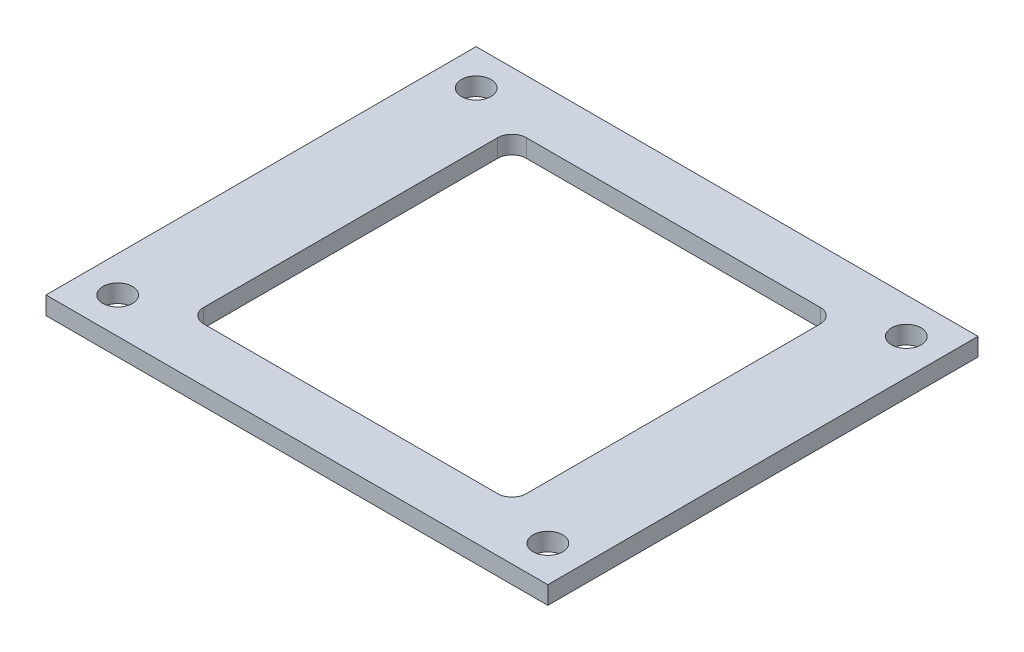
ISO-10303-21;
HEADER;
FILE_DESCRIPTION(('STEP AP214'),'2;1');
FILE_NAME('part.step','',(''),(''),'','','');
FILE_SCHEMA(('AUTOMOTIVE_DESIGN { 1 0 10303 214 1 1 1 1 }'));
ENDSEC;
DATA;
#1=APPLICATION_CONTEXT('core data for automotive mechanical design processes');
#2=APPLICATION_PROTOCOL_DEFINITION('international standard','automotive_design',2000,#1);
#3=PRODUCT_CONTEXT('',#1,'mechanical');
#4=PRODUCT('Part','Part','',(#3));
#5=PRODUCT_RELATED_PRODUCT_CATEGORY('part','',(#4));
#6=PRODUCT_DEFINITION_FORMATION('','',#4);
#7=PRODUCT_DEFINITION_CONTEXT('part definition',#1,'design');
#8=PRODUCT_DEFINITION('design','',#6,#7);
#9=PRODUCT_DEFINITION_SHAPE('','',#8);
#10=(LENGTH_UNIT() NAMED_UNIT(*) SI_UNIT(.MILLI.,.METRE.));
#11=(NAMED_UNIT(*) PLANE_ANGLE_UNIT() SI_UNIT($,.RADIAN.));
#12=(NAMED_UNIT(*) SI_UNIT($,.STERADIAN.) SOLID_ANGLE_UNIT());
#13=UNCERTAINTY_MEASURE_WITH_UNIT(LENGTH_MEASURE(1.E-05),#10,'distance_accuracy_value','');
#14=(GEOMETRIC_REPRESENTATION_CONTEXT(3) GLOBAL_UNCERTAINTY_ASSIGNED_CONTEXT((#13)) GLOBAL_UNIT_ASSIGNED_CONTEXT((#10,
#11,#12)) REPRESENTATION_CONTEXT('',''));
#15=CARTESIAN_POINT('',(0.,0.,0.));
#16=DIRECTION('',(0.,0.,1.));
#17=DIRECTION('',(1.,0.,0.));
#18=AXIS2_PLACEMENT_3D('',#15,#16,#17);
#19=CARTESIAN_POINT('',(0.,2.,24.));
#20=DIRECTION('',(0.,0.,-1.));
#21=DIRECTION('',(-1.,0.,0.));
#22=AXIS2_PLACEMENT_3D('',#19,#20,#21);
#23=PLANE('',#22);
#24=DIRECTION('',(1.,0.,0.));
#25=VECTOR('',#24,1.);
#26=CARTESIAN_POINT('',(0.,0.,24.));
#27=LINE('',#26,#25);
#28=CARTESIAN_POINT('',(-28.,0.,24.));
#29=VERTEX_POINT('',#28);
#30=CARTESIAN_POINT('',(28.,0.,24.));
#31=VERTEX_POINT('',#30);
#32=EDGE_CURVE('E152',#29,#31,#27,.T.);
#33=ORIENTED_EDGE('',*,*,#32,.T.);
#34=DIRECTION('',(0.,-1.,0.));
#35=VECTOR('',#34,1.);
#36=CARTESIAN_POINT('',(28.,2.,24.));
#37=LINE('',#36,#35);
#38=CARTESIAN_POINT('',(28.,2.,24.));
#39=VERTEX_POINT('',#38);
#40=EDGE_CURVE('E134',#39,#31,#37,.T.);
#41=ORIENTED_EDGE('',*,*,#40,.F.);
#42=DIRECTION('',(1.,0.,0.));
#43=VECTOR('',#42,1.);
#44=CARTESIAN_POINT('',(0.,2.,24.));
#45=LINE('',#44,#43);
#46=CARTESIAN_POINT('',(-28.,2.,24.));
#47=VERTEX_POINT('',#46);
#48=EDGE_CURVE('E141',#47,#39,#45,.T.);
#49=ORIENTED_EDGE('',*,*,#48,.F.);
#50=DIRECTION('',(0.,-1.,0.));
#51=VECTOR('',#50,1.);
#52=CARTESIAN_POINT('',(-28.,2.,24.));
#53=LINE('',#52,#51);
#54=EDGE_CURVE('E216',#47,#29,#53,.T.);
#55=ORIENTED_EDGE('',*,*,#54,.T.);
#56=EDGE_LOOP('',(#33,#41,#49,#55));
#57=FACE_BOUND('',#56,.T.);
#58=ADVANCED_FACE('F41',(#57),#23,.F.);
#59=CARTESIAN_POINT('',(28.,2.,0.));
#60=DIRECTION('',(-1.,0.,0.));
#61=DIRECTION('',(0.,0.,1.));
#62=AXIS2_PLACEMENT_3D('',#59,#60,#61);
#63=PLANE('',#62);
#64=DIRECTION('',(0.,0.,-1.));
#65=VECTOR('',#64,1.);
#66=CARTESIAN_POINT('',(28.,0.,0.));
#67=LINE('',#66,#65);
#68=CARTESIAN_POINT('',(28.,0.,-24.));
#69=VERTEX_POINT('',#68);
#70=EDGE_CURVE('E235',#31,#69,#67,.T.);
#71=ORIENTED_EDGE('',*,*,#70,.T.);
#72=DIRECTION('',(0.,-1.,0.));
#73=VECTOR('',#72,1.);
#74=CARTESIAN_POINT('',(28.,2.,-24.));
#75=LINE('',#74,#73);
#76=CARTESIAN_POINT('',(28.,2.,-24.));
#77=VERTEX_POINT('',#76);
#78=EDGE_CURVE('E137',#77,#69,#75,.T.);
#79=ORIENTED_EDGE('',*,*,#78,.F.);
#80=DIRECTION('',(0.,0.,-1.));
#81=VECTOR('',#80,1.);
#82=CARTESIAN_POINT('',(28.,2.,0.));
#83=LINE('',#82,#81);
#84=EDGE_CURVE('E130',#39,#77,#83,.T.);
#85=ORIENTED_EDGE('',*,*,#84,.F.);
#86=ORIENTED_EDGE('',*,*,#40,.T.);
#87=EDGE_LOOP('',(#71,#79,#85,#86));
#88=FACE_BOUND('',#87,.T.);
#89=ADVANCED_FACE('F132',(#88),#63,.F.);
#90=CARTESIAN_POINT('',(0.,2.,-24.));
#91=DIRECTION('',(0.,0.,1.));
#92=DIRECTION('',(1.,0.,0.));
#93=AXIS2_PLACEMENT_3D('',#90,#91,#92);
#94=PLANE('',#93);
#95=DIRECTION('',(-1.,0.,0.));
#96=VECTOR('',#95,1.);
#97=CARTESIAN_POINT('',(0.,0.,-24.));
#98=LINE('',#97,#96);
#99=CARTESIAN_POINT('',(-28.,0.,-24.));
#100=VERTEX_POINT('',#99);
#101=EDGE_CURVE('E237',#69,#100,#98,.T.);
#102=ORIENTED_EDGE('',*,*,#101,.T.);
#103=DIRECTION('',(0.,-1.,0.));
#104=VECTOR('',#103,1.);
#105=CARTESIAN_POINT('',(-28.,2.,-24.));
#106=LINE('',#105,#104);
#107=CARTESIAN_POINT('',(-28.,2.,-24.));
#108=VERTEX_POINT('',#107);
#109=EDGE_CURVE('E157',#108,#100,#106,.T.);
#110=ORIENTED_EDGE('',*,*,#109,.F.);
#111=DIRECTION('',(-1.,0.,0.));
#112=VECTOR('',#111,1.);
#113=CARTESIAN_POINT('',(0.,2.,-24.));
#114=LINE('',#113,#112);
#115=EDGE_CURVE('E140',#77,#108,#114,.T.);
#116=ORIENTED_EDGE('',*,*,#115,.F.);
#117=ORIENTED_EDGE('',*,*,#78,.T.);
#118=EDGE_LOOP('',(#102,#110,#116,#117));
#119=FACE_BOUND('',#118,.T.);
#120=ADVANCED_FACE('F250',(#119),#94,.F.);
#121=CARTESIAN_POINT('',(18.,2.,0.));
#122=DIRECTION('',(-1.,0.,0.));
#123=DIRECTION('',(0.,0.,1.));
#124=AXIS2_PLACEMENT_3D('',#121,#122,#123);
#125=PLANE('',#124);
#126=DIRECTION('',(0.,0.,-1.));
#127=VECTOR('',#126,1.);
#128=CARTESIAN_POINT('',(18.,0.,0.));
#129=LINE('',#128,#127);
#130=CARTESIAN_POINT('',(18.,0.,16.4));
#131=VERTEX_POINT('',#130);
#132=CARTESIAN_POINT('',(18.,0.,-16.4));
#133=VERTEX_POINT('',#132);
#134=EDGE_CURVE('E229',#131,#133,#129,.T.);
#135=ORIENTED_EDGE('',*,*,#134,.F.);
#136=DIRECTION('',(0.,-1.,0.));
#137=VECTOR('',#136,1.);
#138=CARTESIAN_POINT('',(18.,2.,16.4));
#139=LINE('',#138,#137);
#140=CARTESIAN_POINT('',(18.,2.,16.4));
#141=VERTEX_POINT('',#140);
#142=EDGE_CURVE('E171',#131,#141,#139,.F.);
#143=ORIENTED_EDGE('',*,*,#142,.T.);
#144=DIRECTION('',(0.,0.,-1.));
#145=VECTOR('',#144,1.);
#146=CARTESIAN_POINT('',(18.,2.,0.));
#147=LINE('',#146,#145);
#148=CARTESIAN_POINT('',(18.,2.,-16.4));
#149=VERTEX_POINT('',#148);
#150=EDGE_CURVE('E313',#141,#149,#147,.T.);
#151=ORIENTED_EDGE('',*,*,#150,.T.);
#152=DIRECTION('',(0.,-1.,0.));
#153=VECTOR('',#152,1.);
#154=CARTESIAN_POINT('',(18.,2.,-16.4));
#155=LINE('',#154,#153);
#156=EDGE_CURVE('E168',#149,#133,#155,.T.);
#157=ORIENTED_EDGE('',*,*,#156,.T.);
#158=EDGE_LOOP('',(#135,#143,#151,#157));
#159=FACE_BOUND('',#158,.T.);
#160=ADVANCED_FACE('F282',(#159),#125,.T.);
#161=CARTESIAN_POINT('',(0.,2.,18.));
#162=DIRECTION('',(0.,0.,-1.));
#163=DIRECTION('',(-1.,0.,0.));
#164=AXIS2_PLACEMENT_3D('',#161,#162,#163);
#165=PLANE('',#164);
#166=DIRECTION('',(1.,0.,0.));
#167=VECTOR('',#166,1.);
#168=CARTESIAN_POINT('',(0.,0.,18.));
#169=LINE('',#168,#167);
#170=CARTESIAN_POINT('',(-16.4,0.,18.));
#171=VERTEX_POINT('',#170);
#172=CARTESIAN_POINT('',(16.4,0.,18.));
#173=VERTEX_POINT('',#172);
#174=EDGE_CURVE('E204',#171,#173,#169,.T.);
#175=ORIENTED_EDGE('',*,*,#174,.F.);
#176=DIRECTION('',(0.,-1.,0.));
#177=VECTOR('',#176,1.);
#178=CARTESIAN_POINT('',(-16.4,2.,18.));
#179=LINE('',#178,#177);
#180=CARTESIAN_POINT('',(-16.4,2.,18.));
#181=VERTEX_POINT('',#180);
#182=EDGE_CURVE('E166',#171,#181,#179,.F.);
#183=ORIENTED_EDGE('',*,*,#182,.T.);
#184=DIRECTION('',(1.,0.,0.));
#185=VECTOR('',#184,1.);
#186=CARTESIAN_POINT('',(0.,2.,18.));
#187=LINE('',#186,#185);
#188=CARTESIAN_POINT('',(16.4,2.,18.));
#189=VERTEX_POINT('',#188);
#190=EDGE_CURVE('E210',#181,#189,#187,.T.);
#191=ORIENTED_EDGE('',*,*,#190,.T.);
#192=DIRECTION('',(0.,-1.,0.));
#193=VECTOR('',#192,1.);
#194=CARTESIAN_POINT('',(16.4,0.,18.));
#195=LINE('',#194,#193);
#196=EDGE_CURVE('E163',#189,#173,#195,.T.);
#197=ORIENTED_EDGE('',*,*,#196,.T.);
#198=EDGE_LOOP('',(#175,#183,#191,#197));
#199=FACE_BOUND('',#198,.T.);
#200=ADVANCED_FACE('F279',(#199),#165,.T.);
#201=CARTESIAN_POINT('',(-18.,2.,0.));
#202=DIRECTION('',(-1.,0.,0.));
#203=DIRECTION('',(0.,0.,1.));
#204=AXIS2_PLACEMENT_3D('',#201,#202,#203);
#205=PLANE('',#204);
#206=DIRECTION('',(0.,0.,-1.));
#207=VECTOR('',#206,1.);
#208=CARTESIAN_POINT('',(-18.,2.,0.));
#209=LINE('',#208,#207);
#210=CARTESIAN_POINT('',(-18.,2.,16.4));
#211=VERTEX_POINT('',#210);
#212=CARTESIAN_POINT('',(-18.,2.,-16.4));
#213=VERTEX_POINT('',#212);
#214=EDGE_CURVE('E208',#211,#213,#209,.T.);
#215=ORIENTED_EDGE('',*,*,#214,.F.);
#216=DIRECTION('',(0.,-1.,0.));
#217=VECTOR('',#216,1.);
#218=CARTESIAN_POINT('',(-18.,2.,16.4));
#219=LINE('',#218,#217);
#220=CARTESIAN_POINT('',(-18.,0.,16.4));
#221=VERTEX_POINT('',#220);
#222=EDGE_CURVE('E155',#211,#221,#219,.T.);
#223=ORIENTED_EDGE('',*,*,#222,.T.);
#224=DIRECTION('',(0.,0.,-1.));
#225=VECTOR('',#224,1.);
#226=CARTESIAN_POINT('',(-18.,0.,0.));
#227=LINE('',#226,#225);
#228=CARTESIAN_POINT('',(-18.,0.,-16.4));
#229=VERTEX_POINT('',#228);
#230=EDGE_CURVE('E195',#221,#229,#227,.T.);
#231=ORIENTED_EDGE('',*,*,#230,.T.);
#232=DIRECTION('',(0.,-1.,0.));
#233=VECTOR('',#232,1.);
#234=CARTESIAN_POINT('',(-18.,2.,-16.4));
#235=LINE('',#234,#233);
#236=EDGE_CURVE('E153',#229,#213,#235,.F.);
#237=ORIENTED_EDGE('',*,*,#236,.T.);
#238=EDGE_LOOP('',(#215,#223,#231,#237));
#239=FACE_BOUND('',#238,.T.);
#240=ADVANCED_FACE('F202',(#239),#205,.F.);
#241=CARTESIAN_POINT('',(0.,2.,-18.));
#242=DIRECTION('',(0.,0.,-1.));
#243=DIRECTION('',(-1.,0.,0.));
#244=AXIS2_PLACEMENT_3D('',#241,#242,#243);
#245=PLANE('',#244);
#246=DIRECTION('',(1.,0.,0.));
#247=VECTOR('',#246,1.);
#248=CARTESIAN_POINT('',(0.,0.,-18.));
#249=LINE('',#248,#247);
#250=CARTESIAN_POINT('',(-16.4,0.,-18.));
#251=VERTEX_POINT('',#250);
#252=CARTESIAN_POINT('',(16.4,0.,-18.));
#253=VERTEX_POINT('',#252);
#254=EDGE_CURVE('E196',#251,#253,#249,.T.);
#255=ORIENTED_EDGE('',*,*,#254,.T.);
#256=DIRECTION('',(0.,-1.,0.));
#257=VECTOR('',#256,1.);
#258=CARTESIAN_POINT('',(16.4,2.,-18.));
#259=LINE('',#258,#257);
#260=CARTESIAN_POINT('',(16.4,2.,-18.));
#261=VERTEX_POINT('',#260);
#262=EDGE_CURVE('E56',#253,#261,#259,.F.);
#263=ORIENTED_EDGE('',*,*,#262,.T.);
#264=DIRECTION('',(1.,0.,0.));
#265=VECTOR('',#264,1.);
#266=CARTESIAN_POINT('',(0.,2.,-18.));
#267=LINE('',#266,#265);
#268=CARTESIAN_POINT('',(-16.4,2.,-18.));
#269=VERTEX_POINT('',#268);
#270=EDGE_CURVE('E149',#269,#261,#267,.T.);
#271=ORIENTED_EDGE('',*,*,#270,.F.);
#272=DIRECTION('',(0.,-1.,0.));
#273=VECTOR('',#272,1.);
#274=CARTESIAN_POINT('',(-16.4,0.,-18.));
#275=LINE('',#274,#273);
#276=EDGE_CURVE('E173',#269,#251,#275,.T.);
#277=ORIENTED_EDGE('',*,*,#276,.T.);
#278=EDGE_LOOP('',(#255,#263,#271,#277));
#279=FACE_BOUND('',#278,.T.);
#280=ADVANCED_FACE('F206',(#279),#245,.F.);
#281=CARTESIAN_POINT('',(-24.,2.,-20.));
#282=DIRECTION('',(0.,-1.,0.));
#283=DIRECTION('',(0.,0.,-1.));
#284=AXIS2_PLACEMENT_3D('',#281,#282,#283);
#285=CYLINDRICAL_SURFACE('',#284,1.65);
#286=CARTESIAN_POINT('',(-24.,2.,-20.));
#287=DIRECTION('',(0.,1.,0.));
#288=DIRECTION('',(0.,0.,1.));
#289=AXIS2_PLACEMENT_3D('',#286,#287,#288);
#290=CIRCLE('',#289,1.65);
#291=CARTESIAN_POINT('',(-24.,2.,-18.35));
#292=VERTEX_POINT('',#291);
#293=EDGE_CURVE('E317',#292,#292,#290,.T.);
#294=ORIENTED_EDGE('',*,*,#293,.T.);
#295=EDGE_LOOP('',(#294));
#296=FACE_BOUND('',#295,.T.);
#297=CARTESIAN_POINT('',(-24.,0.,-20.));
#298=DIRECTION('',(0.,1.,0.));
#299=DIRECTION('',(0.,0.,1.));
#300=AXIS2_PLACEMENT_3D('',#297,#298,#299);
#301=CIRCLE('',#300,1.65);
#302=CARTESIAN_POINT('',(-24.,0.,-18.35));
#303=VERTEX_POINT('',#302);
#304=EDGE_CURVE('E226',#303,#303,#301,.T.);
#305=ORIENTED_EDGE('',*,*,#304,.F.);
#306=EDGE_LOOP('',(#305));
#307=FACE_BOUND('',#306,.T.);
#308=ADVANCED_FACE('F276',(#296,#307),#285,.F.);
#309=CARTESIAN_POINT('',(-24.,2.,20.));
#310=DIRECTION('',(0.,-1.,0.));
#311=DIRECTION('',(0.,0.,-1.));
#312=AXIS2_PLACEMENT_3D('',#309,#310,#311);
#313=CYLINDRICAL_SURFACE('',#312,1.65);
#314=CARTESIAN_POINT('',(-24.,2.,20.));
#315=DIRECTION('',(0.,1.,0.));
#316=DIRECTION('',(0.,0.,1.));
#317=AXIS2_PLACEMENT_3D('',#314,#315,#316);
#318=CIRCLE('',#317,1.65);
#319=CARTESIAN_POINT('',(-24.,2.,21.65));
#320=VERTEX_POINT('',#319);
#321=EDGE_CURVE('E321',#320,#320,#318,.T.);
#322=ORIENTED_EDGE('',*,*,#321,.T.);
#323=EDGE_LOOP('',(#322));
#324=FACE_BOUND('',#323,.T.);
#325=CARTESIAN_POINT('',(-24.,0.,20.));
#326=DIRECTION('',(0.,1.,0.));
#327=DIRECTION('',(0.,0.,1.));
#328=AXIS2_PLACEMENT_3D('',#325,#326,#327);
#329=CIRCLE('',#328,1.65);
#330=CARTESIAN_POINT('',(-24.,0.,21.65));
#331=VERTEX_POINT('',#330);
#332=EDGE_CURVE('E223',#331,#331,#329,.T.);
#333=ORIENTED_EDGE('',*,*,#332,.F.);
#334=EDGE_LOOP('',(#333));
#335=FACE_BOUND('',#334,.T.);
#336=ADVANCED_FACE('F289',(#324,#335),#313,.F.);
#337=CARTESIAN_POINT('',(24.,2.,-20.));
#338=DIRECTION('',(0.,-1.,0.));
#339=DIRECTION('',(0.,0.,-1.));
#340=AXIS2_PLACEMENT_3D('',#337,#338,#339);
#341=CYLINDRICAL_SURFACE('',#340,1.65);
#342=CARTESIAN_POINT('',(24.,2.,-20.));
#343=DIRECTION('',(0.,1.,0.));
#344=DIRECTION('',(0.,0.,1.));
#345=AXIS2_PLACEMENT_3D('',#342,#343,#344);
#346=CIRCLE('',#345,1.65);
#347=CARTESIAN_POINT('',(24.,2.,-18.35));
#348=VERTEX_POINT('',#347);
#349=EDGE_CURVE('E326',#348,#348,#346,.T.);
#350=ORIENTED_EDGE('',*,*,#349,.T.);
#351=EDGE_LOOP('',(#350));
#352=FACE_BOUND('',#351,.T.);
#353=CARTESIAN_POINT('',(24.,0.,-20.));
#354=DIRECTION('',(0.,1.,0.));
#355=DIRECTION('',(0.,0.,1.));
#356=AXIS2_PLACEMENT_3D('',#353,#354,#355);
#357=CIRCLE('',#356,1.65);
#358=CARTESIAN_POINT('',(24.,0.,-18.35));
#359=VERTEX_POINT('',#358);
#360=EDGE_CURVE('E220',#359,#359,#357,.T.);
#361=ORIENTED_EDGE('',*,*,#360,.F.);
#362=EDGE_LOOP('',(#361));
#363=FACE_BOUND('',#362,.T.);
#364=ADVANCED_FACE('F293',(#352,#363),#341,.F.);
#365=CARTESIAN_POINT('',(24.,2.,20.));
#366=DIRECTION('',(0.,-1.,0.));
#367=DIRECTION('',(0.,0.,-1.));
#368=AXIS2_PLACEMENT_3D('',#365,#366,#367);
#369=CYLINDRICAL_SURFACE('',#368,1.65);
#370=CARTESIAN_POINT('',(24.,2.,20.));
#371=DIRECTION('',(0.,1.,0.));
#372=DIRECTION('',(0.,0.,1.));
#373=AXIS2_PLACEMENT_3D('',#370,#371,#372);
#374=CIRCLE('',#373,1.65);
#375=CARTESIAN_POINT('',(24.,2.,21.65));
#376=VERTEX_POINT('',#375);
#377=EDGE_CURVE('E243',#376,#376,#374,.T.);
#378=ORIENTED_EDGE('',*,*,#377,.T.);
#379=EDGE_LOOP('',(#378));
#380=FACE_BOUND('',#379,.T.);
#381=CARTESIAN_POINT('',(24.,0.,20.));
#382=DIRECTION('',(0.,1.,0.));
#383=DIRECTION('',(0.,0.,1.));
#384=AXIS2_PLACEMENT_3D('',#381,#382,#383);
#385=CIRCLE('',#384,1.65);
#386=CARTESIAN_POINT('',(24.,0.,21.65));
#387=VERTEX_POINT('',#386);
#388=EDGE_CURVE('E217',#387,#387,#385,.T.);
#389=ORIENTED_EDGE('',*,*,#388,.F.);
#390=EDGE_LOOP('',(#389));
#391=FACE_BOUND('',#390,.T.);
#392=ADVANCED_FACE('F297',(#380,#391),#369,.F.);
#393=CARTESIAN_POINT('',(-28.,2.,0.));
#394=DIRECTION('',(-1.,0.,0.));
#395=DIRECTION('',(0.,0.,1.));
#396=AXIS2_PLACEMENT_3D('',#393,#394,#395);
#397=PLANE('',#396);
#398=DIRECTION('',(0.,0.,-1.));
#399=VECTOR('',#398,1.);
#400=CARTESIAN_POINT('',(-28.,0.,0.));
#401=LINE('',#400,#399);
#402=EDGE_CURVE('E240',#29,#100,#401,.T.);
#403=ORIENTED_EDGE('',*,*,#402,.F.);
#404=ORIENTED_EDGE('',*,*,#54,.F.);
#405=DIRECTION('',(0.,0.,-1.));
#406=VECTOR('',#405,1.);
#407=CARTESIAN_POINT('',(-28.,2.,0.));
#408=LINE('',#407,#406);
#409=EDGE_CURVE('E147',#47,#108,#408,.T.);
#410=ORIENTED_EDGE('',*,*,#409,.T.);
#411=ORIENTED_EDGE('',*,*,#109,.T.);
#412=EDGE_LOOP('',(#403,#404,#410,#411));
#413=FACE_BOUND('',#412,.T.);
#414=ADVANCED_FACE('F247',(#413),#397,.T.);
#415=CARTESIAN_POINT('',(0.,2.,0.));
#416=DIRECTION('',(0.,1.,0.));
#417=DIRECTION('',(0.,0.,1.));
#418=AXIS2_PLACEMENT_3D('',#415,#416,#417);
#419=PLANE('',#418);
#420=ORIENTED_EDGE('',*,*,#377,.F.);
#421=EDGE_LOOP('',(#420));
#422=FACE_BOUND('',#421,.T.);
#423=ORIENTED_EDGE('',*,*,#349,.F.);
#424=EDGE_LOOP('',(#423));
#425=FACE_BOUND('',#424,.T.);
#426=ORIENTED_EDGE('',*,*,#321,.F.);
#427=EDGE_LOOP('',(#426));
#428=FACE_BOUND('',#427,.T.);
#429=ORIENTED_EDGE('',*,*,#293,.F.);
#430=EDGE_LOOP('',(#429));
#431=FACE_BOUND('',#430,.T.);
#432=ORIENTED_EDGE('',*,*,#150,.F.);
#433=CARTESIAN_POINT('',(16.4,2.,16.4));
#434=DIRECTION('',(0.,1.,0.));
#435=DIRECTION('',(0.,0.,1.));
#436=AXIS2_PLACEMENT_3D('',#433,#434,#435);
#437=CIRCLE('',#436,1.6);
#438=EDGE_CURVE('E183',#141,#189,#437,.F.);
#439=ORIENTED_EDGE('',*,*,#438,.T.);
#440=ORIENTED_EDGE('',*,*,#190,.F.);
#441=CARTESIAN_POINT('',(-16.4,2.,16.4));
#442=DIRECTION('',(0.,1.,0.));
#443=DIRECTION('',(0.,0.,1.));
#444=AXIS2_PLACEMENT_3D('',#441,#442,#443);
#445=CIRCLE('',#444,1.6);
#446=EDGE_CURVE('E179',#181,#211,#445,.F.);
#447=ORIENTED_EDGE('',*,*,#446,.T.);
#448=ORIENTED_EDGE('',*,*,#214,.T.);
#449=CARTESIAN_POINT('',(-16.4,2.,-16.4));
#450=DIRECTION('',(0.,1.,0.));
#451=DIRECTION('',(0.,0.,1.));
#452=AXIS2_PLACEMENT_3D('',#449,#450,#451);
#453=CIRCLE('',#452,1.6);
#454=EDGE_CURVE('E11',#213,#269,#453,.F.);
#455=ORIENTED_EDGE('',*,*,#454,.T.);
#456=ORIENTED_EDGE('',*,*,#270,.T.);
#457=CARTESIAN_POINT('',(16.4,2.,-16.4));
#458=DIRECTION('',(0.,1.,0.));
#459=DIRECTION('',(0.,0.,1.));
#460=AXIS2_PLACEMENT_3D('',#457,#458,#459);
#461=CIRCLE('',#460,1.6);
#462=EDGE_CURVE('E187',#261,#149,#461,.F.);
#463=ORIENTED_EDGE('',*,*,#462,.T.);
#464=EDGE_LOOP('',(#432,#439,#440,#447,#448,#455,#456,#463));
#465=FACE_BOUND('',#464,.T.);
#466=ORIENTED_EDGE('',*,*,#48,.T.);
#467=ORIENTED_EDGE('',*,*,#84,.T.);
#468=ORIENTED_EDGE('',*,*,#115,.T.);
#469=ORIENTED_EDGE('',*,*,#409,.F.);
#470=EDGE_LOOP('',(#466,#467,#468,#469));
#471=FACE_BOUND('',#470,.T.);
#472=ADVANCED_FACE('F145',(#422,#425,#428,#431,#465,#471),#419,.T.);
#473=CARTESIAN_POINT('',(0.,0.,0.));
#474=DIRECTION('',(0.,1.,0.));
#475=DIRECTION('',(0.,0.,1.));
#476=AXIS2_PLACEMENT_3D('',#473,#474,#475);
#477=PLANE('',#476);
#478=ORIENTED_EDGE('',*,*,#388,.T.);
#479=EDGE_LOOP('',(#478));
#480=FACE_BOUND('',#479,.T.);
#481=ORIENTED_EDGE('',*,*,#360,.T.);
#482=EDGE_LOOP('',(#481));
#483=FACE_BOUND('',#482,.T.);
#484=ORIENTED_EDGE('',*,*,#332,.T.);
#485=EDGE_LOOP('',(#484));
#486=FACE_BOUND('',#485,.T.);
#487=ORIENTED_EDGE('',*,*,#304,.T.);
#488=EDGE_LOOP('',(#487));
#489=FACE_BOUND('',#488,.T.);
#490=ORIENTED_EDGE('',*,*,#174,.T.);
#491=CARTESIAN_POINT('',(16.4,0.,16.4));
#492=DIRECTION('',(0.,1.,0.));
#493=DIRECTION('',(0.,0.,1.));
#494=AXIS2_PLACEMENT_3D('',#491,#492,#493);
#495=CIRCLE('',#494,1.6);
#496=EDGE_CURVE('E181',#173,#131,#495,.T.);
#497=ORIENTED_EDGE('',*,*,#496,.T.);
#498=ORIENTED_EDGE('',*,*,#134,.T.);
#499=CARTESIAN_POINT('',(16.4,0.,-16.4));
#500=DIRECTION('',(0.,1.,0.));
#501=DIRECTION('',(0.,0.,1.));
#502=AXIS2_PLACEMENT_3D('',#499,#500,#501);
#503=CIRCLE('',#502,1.6);
#504=EDGE_CURVE('E185',#133,#253,#503,.T.);
#505=ORIENTED_EDGE('',*,*,#504,.T.);
#506=ORIENTED_EDGE('',*,*,#254,.F.);
#507=CARTESIAN_POINT('',(-16.4,0.,-16.4));
#508=DIRECTION('',(0.,1.,0.));
#509=DIRECTION('',(0.,0.,1.));
#510=AXIS2_PLACEMENT_3D('',#507,#508,#509);
#511=CIRCLE('',#510,1.6);
#512=EDGE_CURVE('E49',#251,#229,#511,.T.);
#513=ORIENTED_EDGE('',*,*,#512,.T.);
#514=ORIENTED_EDGE('',*,*,#230,.F.);
#515=CARTESIAN_POINT('',(-16.4,0.,16.4));
#516=DIRECTION('',(0.,1.,0.));
#517=DIRECTION('',(0.,0.,1.));
#518=AXIS2_PLACEMENT_3D('',#515,#516,#517);
#519=CIRCLE('',#518,1.6);
#520=EDGE_CURVE('E177',#221,#171,#519,.T.);
#521=ORIENTED_EDGE('',*,*,#520,.T.);
#522=EDGE_LOOP('',(#490,#497,#498,#505,#506,#513,#514,#521));
#523=FACE_BOUND('',#522,.T.);
#524=ORIENTED_EDGE('',*,*,#32,.F.);
#525=ORIENTED_EDGE('',*,*,#402,.T.);
#526=ORIENTED_EDGE('',*,*,#101,.F.);
#527=ORIENTED_EDGE('',*,*,#70,.F.);
#528=EDGE_LOOP('',(#524,#525,#526,#527));
#529=FACE_BOUND('',#528,.T.);
#530=ADVANCED_FACE('F193',(#480,#483,#486,#489,#523,#529),#477,.F.);
#531=CARTESIAN_POINT('',(-16.4,2.,16.4));
#532=DIRECTION('',(0.,-1.,0.));
#533=DIRECTION('',(0.,0.,-1.));
#534=AXIS2_PLACEMENT_3D('',#531,#532,#533);
#535=CYLINDRICAL_SURFACE('',#534,1.6);
#536=ORIENTED_EDGE('',*,*,#446,.F.);
#537=ORIENTED_EDGE('',*,*,#182,.F.);
#538=ORIENTED_EDGE('',*,*,#520,.F.);
#539=ORIENTED_EDGE('',*,*,#222,.F.);
#540=EDGE_LOOP('',(#536,#537,#538,#539));
#541=FACE_BOUND('',#540,.T.);
#542=ADVANCED_FACE('F252',(#541),#535,.F.);
#543=CARTESIAN_POINT('',(16.4,2.,16.4));
#544=DIRECTION('',(0.,1.,0.));
#545=DIRECTION('',(0.,0.,1.));
#546=AXIS2_PLACEMENT_3D('',#543,#544,#545);
#547=CYLINDRICAL_SURFACE('',#546,1.6);
#548=ORIENTED_EDGE('',*,*,#438,.F.);
#549=ORIENTED_EDGE('',*,*,#142,.F.);
#550=ORIENTED_EDGE('',*,*,#496,.F.);
#551=ORIENTED_EDGE('',*,*,#196,.F.);
#552=EDGE_LOOP('',(#548,#549,#550,#551));
#553=FACE_BOUND('',#552,.T.);
#554=ADVANCED_FACE('F259',(#553),#547,.F.);
#555=CARTESIAN_POINT('',(16.4,2.,-16.4));
#556=DIRECTION('',(0.,-1.,0.));
#557=DIRECTION('',(0.,0.,-1.));
#558=AXIS2_PLACEMENT_3D('',#555,#556,#557);
#559=CYLINDRICAL_SURFACE('',#558,1.6);
#560=ORIENTED_EDGE('',*,*,#462,.F.);
#561=ORIENTED_EDGE('',*,*,#262,.F.);
#562=ORIENTED_EDGE('',*,*,#504,.F.);
#563=ORIENTED_EDGE('',*,*,#156,.F.);
#564=EDGE_LOOP('',(#560,#561,#562,#563));
#565=FACE_BOUND('',#564,.T.);
#566=ADVANCED_FACE('F303',(#565),#559,.F.);
#567=CARTESIAN_POINT('',(-16.4,2.,-16.4));
#568=DIRECTION('',(0.,1.,0.));
#569=DIRECTION('',(0.,0.,1.));
#570=AXIS2_PLACEMENT_3D('',#567,#568,#569);
#571=CYLINDRICAL_SURFACE('',#570,1.6);
#572=ORIENTED_EDGE('',*,*,#454,.F.);
#573=ORIENTED_EDGE('',*,*,#236,.F.);
#574=ORIENTED_EDGE('',*,*,#512,.F.);
#575=ORIENTED_EDGE('',*,*,#276,.F.);
#576=EDGE_LOOP('',(#572,#573,#574,#575));
#577=FACE_BOUND('',#576,.T.);
#578=ADVANCED_FACE('F43',(#577),#571,.F.);
#579=CLOSED_SHELL('',(#58,#89,#120,#160,#200,#240,#280,#308,#336,#364,#392,#414,#472,#530,#542,
#554,#566,#578));
#580=MANIFOLD_SOLID_BREP('B2',#579);
#581=ADVANCED_BREP_SHAPE_REPRESENTATION('',(#18,#580),#14);
#582=SHAPE_DEFINITION_REPRESENTATION(#9,#581);
ENDSEC;
END-ISO-10303-21;
